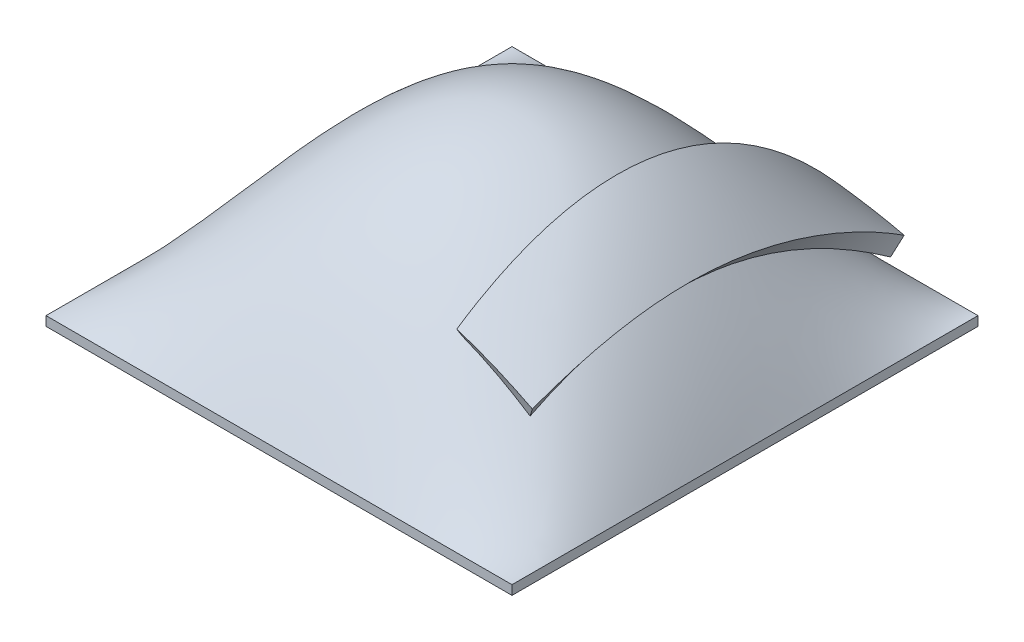
ISO-10303-21;
HEADER;
FILE_DESCRIPTION(('STEP AP214'),'2;1');
FILE_NAME('part.step','',(''),(''),'','','');
FILE_SCHEMA(('AUTOMOTIVE_DESIGN { 1 0 10303 214 1 1 1 1 }'));
ENDSEC;
DATA;
#1=APPLICATION_CONTEXT('core data for automotive mechanical design processes');
#2=APPLICATION_PROTOCOL_DEFINITION('international standard','automotive_design',2000,#1);
#3=PRODUCT_CONTEXT('',#1,'mechanical');
#4=PRODUCT('Part','Part','',(#3));
#5=PRODUCT_RELATED_PRODUCT_CATEGORY('part','',(#4));
#6=PRODUCT_DEFINITION_FORMATION('','',#4);
#7=PRODUCT_DEFINITION_CONTEXT('part definition',#1,'design');
#8=PRODUCT_DEFINITION('design','',#6,#7);
#9=PRODUCT_DEFINITION_SHAPE('','',#8);
#10=(LENGTH_UNIT() NAMED_UNIT(*) SI_UNIT(.MILLI.,.METRE.));
#11=(NAMED_UNIT(*) PLANE_ANGLE_UNIT() SI_UNIT($,.RADIAN.));
#12=(NAMED_UNIT(*) SI_UNIT($,.STERADIAN.) SOLID_ANGLE_UNIT());
#13=UNCERTAINTY_MEASURE_WITH_UNIT(LENGTH_MEASURE(1.E-05),#10,'distance_accuracy_value','');
#14=(GEOMETRIC_REPRESENTATION_CONTEXT(3) GLOBAL_UNCERTAINTY_ASSIGNED_CONTEXT((#13)) GLOBAL_UNIT_ASSIGNED_CONTEXT((#10,
#11,#12)) REPRESENTATION_CONTEXT('',''));
#15=CARTESIAN_POINT('',(0.,0.,0.));
#16=DIRECTION('',(0.,0.,1.));
#17=DIRECTION('',(1.,0.,0.));
#18=AXIS2_PLACEMENT_3D('',#15,#16,#17);
#19=CARTESIAN_POINT('',(352.236400812417,120.066074002992,-94.2678080648068));
#20=CARTESIAN_POINT('',(377.945252083481,110.12521398894,-94.2678080648068));
#21=CARTESIAN_POINT('',(402.095541932773,97.1447702594201,-94.2678080648068));
#22=CARTESIAN_POINT('',(425.149182787163,82.1038303366709,-94.2678080648068));
#23=CARTESIAN_POINT('',(358.101117434809,135.233285610329,-82.6247504338713));
#24=CARTESIAN_POINT('',(385.315926838237,125.438076267371,-83.5730522108363));
#25=CARTESIAN_POINT('',(410.914883568745,112.603418602778,-84.9006707677994));
#26=CARTESIAN_POINT('',(435.241527300565,97.5726299586179,-86.5957274813633));
#27=B_SPLINE_SURFACE_WITH_KNOTS('',1,3,((#19,#20,#21,#22),(#23,#24,#25,#26)),.UNSPECIFIED.,.F.,
.F.,.F.,(2,2),(4,4),(0.,1.),(0.,0.0822034410440224),.UNSPECIFIED.);
#28=CARTESIAN_POINT('',(352.236400812416,120.066074002992,-94.2678080648068));
#29=CARTESIAN_POINT('',(358.101117434809,135.233285610329,-82.6247504338713));
#30=B_SPLINE_CURVE_WITH_KNOTS('',1,(#28,#29),.UNSPECIFIED.,.F.,.F.,(2,2),(0.,1.),.UNSPECIFIED.);
#31=CARTESIAN_POINT('',(352.236400812417,120.066074002992,-94.2678080648068));
#32=VERTEX_POINT('',#31);
#33=CARTESIAN_POINT('',(358.101117434809,135.233285610329,-82.6247504338714));
#34=VERTEX_POINT('',#33);
#35=EDGE_CURVE('E12',#32,#34,#30,.T.);
#36=CARTESIAN_POINT('',(352.236400812417,120.066074002992,-94.2678080648068));
#37=CARTESIAN_POINT('',(377.945252083481,110.12521398894,-94.2678080648068));
#38=CARTESIAN_POINT('',(402.095541932773,97.1447702594201,-94.2678080648068));
#39=CARTESIAN_POINT('',(425.149182787163,82.1038303366709,-94.2678080648068));
#40=B_SPLINE_CURVE_WITH_KNOTS('',3,(#36,#37,#38,#39),.UNSPECIFIED.,.F.,.F.,(4,4),(0.,
0.0822034410440224),.UNSPECIFIED.);
#41=CARTESIAN_POINT('',(425.149182787163,82.1038303366709,-94.2678080648068));
#42=VERTEX_POINT('',#41);
#43=EDGE_CURVE('E109',#32,#42,#40,.T.);
#44=CARTESIAN_POINT('',(425.149182787163,82.1038303366709,-94.2678080648068));
#45=CARTESIAN_POINT('',(435.241527300565,97.5726299586179,-86.5957274813633));
#46=B_SPLINE_CURVE_WITH_KNOTS('',1,(#44,#45),.UNSPECIFIED.,.F.,.F.,(2,2),(0.,1.),.UNSPECIFIED.);
#47=CARTESIAN_POINT('',(435.241527300565,97.5726299586179,-86.5957274813632));
#48=VERTEX_POINT('',#47);
#49=EDGE_CURVE('E67',#42,#48,#46,.T.);
#50=CARTESIAN_POINT('',(358.101117434493,135.23328560985,-82.6247504330873));
#51=CARTESIAN_POINT('',(361.444734268746,134.029851197963,-82.7412492825079));
#52=CARTESIAN_POINT('',(364.770347542425,132.777275873528,-82.8635414172661));
#53=CARTESIAN_POINT('',(371.391332329243,130.175291545743,-83.1201324649657));
#54=CARTESIAN_POINT('',(374.686622964419,128.825679144149,-83.2544567522162));
#55=CARTESIAN_POINT('',(381.246352683932,126.032862993513,-83.5353764652534));
#56=CARTESIAN_POINT('',(384.510695517026,124.589436411588,-83.6820013673793));
#57=CARTESIAN_POINT('',(391.007869537081,121.612186170239,-83.9877115174486));
#58=CARTESIAN_POINT('',(394.240592997445,120.078130901453,-84.1468290653904));
#59=CARTESIAN_POINT('',(400.673717347923,116.922798871033,-84.477627181016));
#60=CARTESIAN_POINT('',(403.874002961273,115.301290807412,-84.6493415453925));
#61=CARTESIAN_POINT('',(410.241321638015,111.974206616375,-85.0053123902598));
#62=CARTESIAN_POINT('',(413.408235973908,110.268407034871,-85.1896027623035));
#63=CARTESIAN_POINT('',(419.707751682306,106.775902709061,-85.5705687418883));
#64=CARTESIAN_POINT('',(422.840234900779,104.98898859197,-85.7672769807413));
#65=CARTESIAN_POINT('',(429.069753165836,101.337370442496,-86.1726986319459));
#66=CARTESIAN_POINT('',(432.166674659702,99.4724759554449,-86.3814419729632));
#67=CARTESIAN_POINT('',(435.24152729993,97.5726299585376,-86.5957274803656));
#68=B_SPLINE_CURVE_WITH_KNOTS('',3,(#50,#51,#52,#53,#54,#55,#56,#57,#58,#59,#60,#61,#62,#63,#64,
#65,#66,#67),.UNSPECIFIED.,.F.,.F.,(4,2,2,2,2,2,2,2,4),(0.,10.6659610616537,21.3549701091742,
32.07036823324,42.8144463522021,53.588486143564,64.3928047841374,75.2268026284994,
86.0890132259185),.UNSPECIFIED.);
#69=EDGE_CURVE('E105',#34,#48,#68,.T.);
#70=ORIENTED_EDGE('',*,*,#35,.F.);
#71=ORIENTED_EDGE('',*,*,#43,.T.);
#72=ORIENTED_EDGE('',*,*,#49,.T.);
#73=ORIENTED_EDGE('',*,*,#69,.F.);
#74=EDGE_LOOP('',(#70,#71,#72,#73));
#75=FACE_BOUND('',#74,.T.);
#76=ADVANCED_FACE('F53',(#75),#27,.F.);
#77=CARTESIAN_POINT('',(425.149182787163,82.1038303366709,-94.2678080648068));
#78=CARTESIAN_POINT('',(425.149182787163,89.7890454692226,-109.763090165147));
#79=CARTESIAN_POINT('',(425.149182787163,96.5278335099268,-125.537576367402));
#80=CARTESIAN_POINT('',(425.149182787163,107.783459375476,-157.741472525574));
#81=CARTESIAN_POINT('',(425.149182787163,112.30095832823,-174.170772784166));
#82=CARTESIAN_POINT('',(425.149182787163,117.136291045383,-199.386960395024));
#83=CARTESIAN_POINT('',(425.149182787163,118.424222885114,-207.887835209389));
#84=CARTESIAN_POINT('',(425.149182787163,119.832004756214,-220.793671720011));
#85=CARTESIAN_POINT('',(425.149182787163,120.214031015862,-225.129447168117));
#86=CARTESIAN_POINT('',(425.149182787163,120.792230526057,-233.766937602276));
#87=CARTESIAN_POINT('',(425.149182787163,120.989723896549,-238.077678158576));
#88=CARTESIAN_POINT('',(425.149182787163,121.523814709346,-259.591764472096));
#89=CARTESIAN_POINT('',(425.149182787163,120.499279720612,-276.676173067539));
#90=CARTESIAN_POINT('',(425.149182787163,116.886755191908,-302.121407218186));
#91=CARTESIAN_POINT('',(425.149182787163,115.336821721953,-310.572939188076));
#92=CARTESIAN_POINT('',(425.149182787163,111.564874089812,-327.417276020784));
#93=CARTESIAN_POINT('',(425.149182787163,109.333503336945,-335.833167727256));
#94=CARTESIAN_POINT('',(425.149182787163,101.799330225185,-360.594014454023));
#95=CARTESIAN_POINT('',(425.149182787163,95.6397662800098,-376.579373060685));
#96=CARTESIAN_POINT('',(425.149182787163,81.4868513833054,-407.708237394581));
#97=CARTESIAN_POINT('',(425.149182787163,73.4923327884509,-422.851207081427));
#98=CARTESIAN_POINT('',(425.149182787163,56.0216225445363,-452.456941653398));
#99=CARTESIAN_POINT('',(425.149182787163,46.5257050296974,-466.942758903788));
#100=CARTESIAN_POINT('',(425.149182787163,36.5334746410542,-481.022564626507));
#101=CARTESIAN_POINT('',(435.241527300565,97.5726299586179,-86.5957274813633));
#102=CARTESIAN_POINT('',(436.233424626653,105.026604275157,-102.929576332862));
#103=CARTESIAN_POINT('',(437.00419136778,111.517095162358,-119.548321541818));
#104=CARTESIAN_POINT('',(438.204772920203,122.338026438718,-153.404825136524));
#105=CARTESIAN_POINT('',(438.636107316384,126.66769081833,-170.643063368185));
#106=CARTESIAN_POINT('',(439.08263809119,131.300258661409,-197.05735484505));
#107=CARTESIAN_POINT('',(439.197692847754,132.533504477032,-205.95542845543));
#108=CARTESIAN_POINT('',(439.322166691158,133.881336567008,-219.457832139951));
#109=CARTESIAN_POINT('',(439.355621021046,134.247045724089,-223.992973114744));
#110=CARTESIAN_POINT('',(439.406080086624,134.800524800578,-233.026307276474));
#111=CARTESIAN_POINT('',(439.423202183896,134.989558402925,-237.533947777272));
#112=CARTESIAN_POINT('',(439.469494381663,135.500769707903,-260.029512748442));
#113=CARTESIAN_POINT('',(439.383456451259,134.520554976663,-277.889793543398));
#114=CARTESIAN_POINT('',(439.059376880399,131.061139321741,-304.522288333706));
#115=CARTESIAN_POINT('',(438.918300344834,129.576598325328,-313.373423444975));
#116=CARTESIAN_POINT('',(438.561822250962,125.961297929071,-331.029288113601));
#117=CARTESIAN_POINT('',(438.34539420171,123.821572301028,-339.858362523521));
#118=CARTESIAN_POINT('',(437.58014307637,116.588556775169,-365.860448632355));
#119=CARTESIAN_POINT('',(436.914059955395,110.667095792958,-382.683772575163));
#120=CARTESIAN_POINT('',(435.189725834188,96.9864089050762,-415.483060380142));
#121=CARTESIAN_POINT('',(434.12826770031,89.2265071831388,-431.459331630104));
#122=CARTESIAN_POINT('',(431.551302542576,72.0878189705827,-462.614609350392));
#123=CARTESIAN_POINT('',(430.026565407345,62.6867262670528,-477.814313942201));
#124=CARTESIAN_POINT('',(428.339469775556,52.6347166266389,-492.449378506733));
#125=B_SPLINE_SURFACE_WITH_KNOTS('',1,3,((#77,#78,#79,#80,#81,#82,#83,#84,#85,#86,#87,#88,#89,
#90,#91,#92,#93,#94,#95,#96,#97,#98,#99,#100),(#101,#102,#103,#104,#105,#106,#107,#108,#109,
#110,#111,#112,#113,#114,#115,#116,#117,#118,#119,#120,#121,#122,#123,#124)),.UNSPECIFIED.,.F.,
.F.,.F.,(2,2),(4,2,2,2,2,2,2,2,2,2,2,4),(0.,1.),(0.,0.0511085665816319,0.102217133163264,
0.12777141645408,0.140548558099488,0.153325699744896,0.204434266326528,0.229988549617344,
0.25554283290816,0.306651399489792,0.357759966071424,0.408868532653056),.UNSPECIFIED.);
#126=CARTESIAN_POINT('',(425.149182787163,82.1038303366709,-94.2678080648068));
#127=CARTESIAN_POINT('',(425.149182787163,89.7890454692226,-109.763090165147));
#128=CARTESIAN_POINT('',(425.149182787163,96.5278335099268,-125.537576367402));
#129=CARTESIAN_POINT('',(425.149182787163,107.783459375476,-157.741472525574));
#130=CARTESIAN_POINT('',(425.149182787163,112.30095832823,-174.170772784166));
#131=CARTESIAN_POINT('',(425.149182787163,117.136291045383,-199.386960395024));
#132=CARTESIAN_POINT('',(425.149182787163,118.424222885114,-207.887835209389));
#133=CARTESIAN_POINT('',(425.149182787163,119.832004756214,-220.793671720011));
#134=CARTESIAN_POINT('',(425.149182787163,120.214031015862,-225.129447168117));
#135=CARTESIAN_POINT('',(425.149182787163,120.792230526057,-233.766937602276));
#136=CARTESIAN_POINT('',(425.149182787163,120.989723896549,-238.077678158576));
#137=CARTESIAN_POINT('',(425.149182787163,121.523814709346,-259.591764472096));
#138=CARTESIAN_POINT('',(425.149182787163,120.499279720612,-276.676173067539));
#139=CARTESIAN_POINT('',(425.149182787163,116.886755191908,-302.121407218186));
#140=CARTESIAN_POINT('',(425.149182787163,115.336821721953,-310.572939188076));
#141=CARTESIAN_POINT('',(425.149182787163,111.564874089812,-327.417276020784));
#142=CARTESIAN_POINT('',(425.149182787163,109.333503336945,-335.833167727256));
#143=CARTESIAN_POINT('',(425.149182787163,101.799330225185,-360.594014454023));
#144=CARTESIAN_POINT('',(425.149182787163,95.6397662800098,-376.579373060685));
#145=CARTESIAN_POINT('',(425.149182787163,81.4868513833054,-407.708237394581));
#146=CARTESIAN_POINT('',(425.149182787163,73.4923327884509,-422.851207081427));
#147=CARTESIAN_POINT('',(425.149182787163,56.0216225445363,-452.456941653398));
#148=CARTESIAN_POINT('',(425.149182787163,46.5257050296974,-466.942758903788));
#149=CARTESIAN_POINT('',(425.149182787163,36.5334746410542,-481.022564626507));
#150=B_SPLINE_CURVE_WITH_KNOTS('',3,(#126,#127,#128,#129,#130,#131,#132,#133,#134,#135,#136,
#137,#138,#139,#140,#141,#142,#143,#144,#145,#146,#147,#148,#149),.UNSPECIFIED.,.F.,.F.,(4,2,2,
2,2,2,2,2,2,2,2,4),(0.,0.0511085665816319,0.102217133163264,0.12777141645408,0.140548558099488,
0.153325699744896,0.204434266326528,0.229988549617344,0.25554283290816,0.306651399489792,
0.357759966071424,0.408868532653056),.UNSPECIFIED.);
#151=CARTESIAN_POINT('',(425.149182787163,36.5334746410542,-481.022564626507));
#152=VERTEX_POINT('',#151);
#153=EDGE_CURVE('E259',#42,#152,#150,.T.);
#154=CARTESIAN_POINT('',(425.149182787163,36.5334746410542,-481.022564626507));
#155=CARTESIAN_POINT('',(428.339469775556,52.6347166266389,-492.449378506733));
#156=B_SPLINE_CURVE_WITH_KNOTS('',1,(#154,#155),.UNSPECIFIED.,.F.,.F.,(2,2),(0.,1.),.UNSPECIFIED.);
#157=CARTESIAN_POINT('',(428.339469775556,52.6347166266389,-492.449378506733));
#158=VERTEX_POINT('',#157);
#159=EDGE_CURVE('E92',#152,#158,#156,.T.);
#160=CARTESIAN_POINT('',(435.241527298709,97.5726299592417,-86.5957274801786));
#161=CARTESIAN_POINT('',(435.550025724608,99.8895489927879,-91.6731279335697));
#162=CARTESIAN_POINT('',(435.838083007822,102.119185255935,-96.7919761303514));
#163=CARTESIAN_POINT('',(436.382337493342,106.44834588407,-107.243114448448));
#164=CARTESIAN_POINT('',(436.637508279255,108.542962621753,-112.577489947589));
#165=CARTESIAN_POINT('',(437.11487515228,112.573039096736,-123.456399979805));
#166=CARTESIAN_POINT('',(437.336113381553,114.503360545532,-129.002885016989));
#167=CARTESIAN_POINT('',(437.745724993086,118.174114653905,-140.303678284412));
#168=CARTESIAN_POINT('',(437.933207350484,119.909041461866,-146.05981152867));
#169=CARTESIAN_POINT('',(438.275843539332,123.157075598125,-157.778740112243));
#170=CARTESIAN_POINT('',(438.430151669346,124.664141446356,-163.743239445451));
#171=CARTESIAN_POINT('',(438.707166364176,127.423249367794,-175.87899159863));
#172=CARTESIAN_POINT('',(438.829048341369,128.668493493044,-182.051815375181));
#173=CARTESIAN_POINT('',(439.032440667158,130.780309272881,-194.092258715403));
#174=CARTESIAN_POINT('',(439.115888741719,131.664710121038,-199.956717469806));
#175=CARTESIAN_POINT('',(439.254908686877,133.153116520304,-211.797974989736));
#176=CARTESIAN_POINT('',(439.310109572844,133.753383092274,-217.775250246997));
#177=CARTESIAN_POINT('',(439.392833705086,134.655808426855,-229.84458737325));
#178=CARTESIAN_POINT('',(439.419920251521,134.953262283042,-235.937005537371));
#179=CARTESIAN_POINT('',(439.444843623762,135.22860049845,-248.052615369924));
#180=CARTESIAN_POINT('',(439.443043244598,135.210448356432,-254.075716326473));
#181=CARTESIAN_POINT('',(439.411641785372,134.865622886129,-266.057243514065));
#182=CARTESIAN_POINT('',(439.382297936632,134.541804053056,-272.015752767737));
#183=CARTESIAN_POINT('',(439.295835133701,133.596932031284,-283.870638744747));
#184=CARTESIAN_POINT('',(439.238894220986,132.977784544618,-289.767169511933));
#185=CARTESIAN_POINT('',(439.090797907635,131.396147496109,-301.942914363653));
#186=CARTESIAN_POINT('',(438.997486141308,130.412263208353,-308.219325864267));
#187=CARTESIAN_POINT('',(438.77854930873,128.153628058575,-320.559392237248));
#188=CARTESIAN_POINT('',(438.653774416758,126.886616876496,-326.624485809845));
#189=CARTESIAN_POINT('',(438.371783449229,124.097374012755,-338.542586378563));
#190=CARTESIAN_POINT('',(438.215409573425,122.58192951383,-344.397206675847));
#191=CARTESIAN_POINT('',(437.869805325657,119.329938444242,-355.893896469225));
#192=CARTESIAN_POINT('',(437.681440094271,117.599473076888,-361.537717176437));
#193=CARTESIAN_POINT('',(437.271529107284,113.94997673928,-372.611301108909));
#194=CARTESIAN_POINT('',(437.050896358338,112.036520707858,-378.042939663848));
#195=CARTESIAN_POINT('',(436.576668440212,108.051954561468,-388.689526714838));
#196=CARTESIAN_POINT('',(436.324050268623,105.986068396264,-393.906478319972));
#197=CARTESIAN_POINT('',(435.762078916937,101.527347529968,-404.596216031404));
#198=CARTESIAN_POINT('',(435.450108228983,99.1219967875963,-410.063641861739));
#199=CARTESIAN_POINT('',(434.781219835167,94.1325592084239,-420.861373251688));
#200=CARTESIAN_POINT('',(434.424672553475,91.5500165761368,-426.19241660131));
#201=CARTESIAN_POINT('',(433.66619932585,86.2249085581973,-436.710475985167));
#202=CARTESIAN_POINT('',(433.264708225952,83.4839828287165,-441.898354171639));
#203=CARTESIAN_POINT('',(432.424142482574,77.8920820203802,-452.063357696328));
#204=CARTESIAN_POINT('',(431.986080187737,75.0448178788584,-457.042611328217));
#205=CARTESIAN_POINT('',(431.048974888,69.0915590452125,-467.076503838063));
#206=CARTESIAN_POINT('',(430.548335790997,65.9799998366897,-472.127696063555));
#207=CARTESIAN_POINT('',(429.757777341442,61.1517479066766,-479.687091172888));
#208=CARTESIAN_POINT('',(429.484059913739,59.4942308130503,-482.235002233857));
#209=CARTESIAN_POINT('',(428.921728786738,56.1101966369559,-487.343700318775));
#210=CARTESIAN_POINT('',(428.632944516266,54.3829940294157,-489.904014518118));
#211=CARTESIAN_POINT('',(428.33946977556,52.6347166271178,-492.449378506057));
#212=B_SPLINE_CURVE_WITH_KNOTS('',3,(#160,#161,#162,#163,#164,#165,#166,#167,#168,#169,#170,
#171,#172,#173,#174,#175,#176,#177,#178,#179,#180,#181,#182,#183,#184,#185,#186,#187,#188,#189,
#190,#191,#192,#193,#194,#195,#196,#197,#198,#199,#200,#201,#202,#203,#204,#205,#206,#207,#208,
#209,#210,#211),.UNSPECIFIED.,.F.,.F.,(4,2,2,2,2,2,2,2,2,2,2,2,2,2,2,2,2,2,2,2,2,2,2,2,2,4),(0.,
16.7683576188505,33.973883282391,51.5997375403208,69.6383818728655,88.0932215564224,
106.9801982578,124.767274280378,142.782319464316,161.073184992336,179.134514733145,
197.028828570356,214.809204341297,233.861644945573,252.446015830021,270.588358530947,
288.301354945864,305.585812534214,322.432259205644,340.371643615796,358.170792182113,
375.810587936847,393.065124607215,410.92265645697,420.078003641002,429.383330601827),.UNSPECIFIED.);
#213=EDGE_CURVE('E122',#48,#158,#212,.T.);
#214=ORIENTED_EDGE('',*,*,#49,.F.);
#215=ORIENTED_EDGE('',*,*,#153,.T.);
#216=ORIENTED_EDGE('',*,*,#159,.T.);
#217=ORIENTED_EDGE('',*,*,#213,.F.);
#218=EDGE_LOOP('',(#214,#215,#216,#217));
#219=FACE_BOUND('',#218,.T.);
#220=ADVANCED_FACE('F130',(#219),#125,.F.);
#221=CARTESIAN_POINT('',(425.149182787163,36.5334746410542,-481.022564626507));
#222=CARTESIAN_POINT('',(413.064708675619,38.9278825105924,-481.022564626507));
#223=CARTESIAN_POINT('',(400.951573272072,41.145857470725,-481.022564626507));
#224=CARTESIAN_POINT('',(376.651418929949,45.1284618134063,-481.022564626507));
#225=CARTESIAN_POINT('',(364.464614535963,46.8940912076447,-481.022564626507));
#226=CARTESIAN_POINT('',(352.236400812417,48.4056309159132,-481.022564626507));
#227=CARTESIAN_POINT('',(428.339469775555,52.6347166266389,-492.449378506733));
#228=CARTESIAN_POINT('',(415.968178233862,54.3882947761706,-493.432433313311));
#229=CARTESIAN_POINT('',(403.57330637072,56.0323120486455,-494.142714048289));
#230=CARTESIAN_POINT('',(378.749384083769,59.0395944710793,-495.259743616212));
#231=CARTESIAN_POINT('',(366.319298514458,60.4004951141268,-495.664926532226));
#232=CARTESIAN_POINT('',(353.864930939866,61.5802861001252,-495.981720698996));
#233=B_SPLINE_SURFACE_WITH_KNOTS('',1,3,((#221,#222,#223,#224,#225,#226),(#227,#228,#229,#230,
#231,#232)),.UNSPECIFIED.,.F.,.F.,.F.,(2,2),(4,2,4),(0.,1.),(0.,0.0369365058915689,
0.0738730117831378),.UNSPECIFIED.);
#234=CARTESIAN_POINT('',(425.149182787163,36.5334746410542,-481.022564626507));
#235=CARTESIAN_POINT('',(413.064708675619,38.9278825105924,-481.022564626507));
#236=CARTESIAN_POINT('',(400.951573272072,41.145857470725,-481.022564626507));
#237=CARTESIAN_POINT('',(376.651418929949,45.1284618134063,-481.022564626507));
#238=CARTESIAN_POINT('',(364.464614535963,46.8940912076447,-481.022564626507));
#239=CARTESIAN_POINT('',(352.236400812417,48.4056309159132,-481.022564626507));
#240=B_SPLINE_CURVE_WITH_KNOTS('',3,(#234,#235,#236,#237,#238,#239),.UNSPECIFIED.,.F.,.F.,(4,2,
4),(0.,0.0369365058915689,0.0738730117831378),.UNSPECIFIED.);
#241=CARTESIAN_POINT('',(352.236400812417,48.4056309159133,-481.022564626507));
#242=VERTEX_POINT('',#241);
#243=EDGE_CURVE('E251',#152,#242,#240,.T.);
#244=CARTESIAN_POINT('',(352.236400812417,48.4056309159132,-481.022564626507));
#245=CARTESIAN_POINT('',(353.864930939866,61.5802861001252,-495.981720698996));
#246=B_SPLINE_CURVE_WITH_KNOTS('',1,(#244,#245),.UNSPECIFIED.,.F.,.F.,(2,2),(0.,1.),.UNSPECIFIED.);
#247=CARTESIAN_POINT('',(353.864930939866,61.5802861001254,-495.981720698996));
#248=VERTEX_POINT('',#247);
#249=EDGE_CURVE('E75',#242,#248,#246,.T.);
#250=CARTESIAN_POINT('',(428.33946977556,52.6347166271178,-492.449378506057));
#251=CARTESIAN_POINT('',(425.46362161693,53.0422608946533,-492.677885050296));
#252=CARTESIAN_POINT('',(422.585787901229,53.4438724941487,-492.891590157503));
#253=CARTESIAN_POINT('',(416.682563794214,54.2544397002916,-493.302632973978));
#254=CARTESIAN_POINT('',(413.656991422397,54.6627581813399,-493.498617709115));
#255=CARTESIAN_POINT('',(407.45953591285,55.4839717572973,-493.873851818407));
#256=CARTESIAN_POINT('',(404.287487215432,55.8961732446849,-494.051874707102));
#257=CARTESIAN_POINT('',(397.798089248989,56.7214948991304,-494.391438882842));
#258=CARTESIAN_POINT('',(394.480583420196,57.1338324279323,-494.551887657588));
#259=CARTESIAN_POINT('',(388.26418165337,57.8869403704757,-494.831579771275));
#260=CARTESIAN_POINT('',(385.365698278769,58.2301438956943,-494.953468390434));
#261=CARTESIAN_POINT('',(379.428868232035,58.9159605733343,-495.187637826006));
#262=CARTESIAN_POINT('',(376.390400574642,59.2577755454285,-495.299189952688));
#263=CARTESIAN_POINT('',(370.17403029286,59.9371153982096,-495.512584803249));
#264=CARTESIAN_POINT('',(366.996008110026,60.27375449562,-495.61376439893));
#265=CARTESIAN_POINT('',(360.500842253214,60.9386480121268,-495.806397749039));
#266=CARTESIAN_POINT('',(357.183580370047,61.2659228288699,-495.897247882204));
#267=CARTESIAN_POINT('',(353.864930939877,61.5802861002212,-495.981720698911));
#268=B_SPLINE_CURVE_WITH_KNOTS('',3,(#250,#251,#252,#253,#254,#255,#256,#257,#258,#259,#260,
#261,#262,#263,#264,#265,#266,#267),.UNSPECIFIED.,.F.,.F.,(4,2,2,2,2,2,2,2,4),(0.,
8.74058027963798,17.918268656855,27.5291318889666,37.5696241287311,46.3333664951743,
55.5122722676336,65.1043738043576,75.1080654637357),.UNSPECIFIED.);
#269=EDGE_CURVE('E132',#158,#248,#268,.T.);
#270=ORIENTED_EDGE('',*,*,#159,.F.);
#271=ORIENTED_EDGE('',*,*,#243,.T.);
#272=ORIENTED_EDGE('',*,*,#249,.T.);
#273=ORIENTED_EDGE('',*,*,#269,.F.);
#274=EDGE_LOOP('',(#270,#271,#272,#273));
#275=FACE_BOUND('',#274,.T.);
#276=ADVANCED_FACE('F154',(#275),#233,.F.);
#277=CARTESIAN_POINT('',(352.236400812417,48.4056309159133,-481.022564626507));
#278=CARTESIAN_POINT('',(352.236400812417,62.3051771364765,-468.781116794453));
#279=CARTESIAN_POINT('',(352.236400812416,75.659405150921,-456.066232453297));
#280=CARTESIAN_POINT('',(352.236400812416,100.950669402067,-429.409740191528));
#281=CARTESIAN_POINT('',(352.236400812417,112.892326829261,-415.471627259768));
#282=CARTESIAN_POINT('',(352.236400812417,129.357112090125,-393.310286787096));
#283=CARTESIAN_POINT('',(352.236400812417,134.602254143988,-385.712554031248));
#284=CARTESIAN_POINT('',(352.236400812417,142.031059534526,-373.935720736288));
#285=CARTESIAN_POINT('',(352.236400812416,144.438975906297,-369.937268315959));
#286=CARTESIAN_POINT('',(352.236400812416,149.055963616309,-361.865248548761));
#287=CARTESIAN_POINT('',(352.236400812417,151.267547704373,-357.788580161907));
#288=CARTESIAN_POINT('',(352.236400812417,161.809592171402,-337.188802406967));
#289=CARTESIAN_POINT('',(352.236400812416,168.610578881897,-320.024002195017));
#290=CARTESIAN_POINT('',(352.236400812416,174.409027815541,-297.434048418407));
#291=CARTESIAN_POINT('',(352.236400812417,175.427412532899,-292.873211723236));
#292=CARTESIAN_POINT('',(352.236400812417,177.151996202698,-283.765373503908));
#293=CARTESIAN_POINT('',(352.236400812417,177.862042214644,-279.203960755429));
#294=CARTESIAN_POINT('',(352.236400812417,179.530766806554,-265.497011439006));
#295=CARTESIAN_POINT('',(352.236400812416,180.028039426715,-256.328764168445));
#296=CARTESIAN_POINT('',(352.236400812416,179.767041612934,-237.930470978399));
#297=CARTESIAN_POINT('',(352.236400812417,179.005687470834,-228.680493486514));
#298=CARTESIAN_POINT('',(352.236400812417,176.214895830485,-210.200406096642));
#299=CARTESIAN_POINT('',(352.236400812417,174.215952359266,-201.146152032938));
#300=CARTESIAN_POINT('',(352.236400812417,169.14435362316,-183.368163820322));
#301=CARTESIAN_POINT('',(352.236400812417,166.071506543749,-174.644488717533));
#302=CARTESIAN_POINT('',(352.236400812417,158.962680577723,-157.493618670529));
#303=CARTESIAN_POINT('',(352.236400812417,154.913190194638,-149.04883337829));
#304=CARTESIAN_POINT('',(352.236400812417,141.69433904288,-124.508296813998));
#305=CARTESIAN_POINT('',(352.236400812416,131.417083849911,-109.054574029768));
#306=CARTESIAN_POINT('',(352.236400812416,120.066074002992,-94.2678080648068));
#307=CARTESIAN_POINT('',(353.864930939866,61.5802861001254,-495.981720698996));
#308=CARTESIAN_POINT('',(354.602339786976,75.8293006539433,-483.352215059131));
#309=CARTESIAN_POINT('',(355.357189662493,89.5385723625534,-470.1614125099));
#310=CARTESIAN_POINT('',(356.867644993561,115.538939784781,-442.324021082801));
#311=CARTESIAN_POINT('',(357.623700367342,127.834892838037,-427.681166167659));
#312=CARTESIAN_POINT('',(358.716174244385,144.813620730968,-404.239738092949));
#313=CARTESIAN_POINT('',(359.073186088483,150.227058418053,-396.1780061147));
#314=CARTESIAN_POINT('',(359.58986627117,157.900193367441,-383.641265251986));
#315=CARTESIAN_POINT('',(359.759290626305,160.388359339017,-379.378202338163));
#316=CARTESIAN_POINT('',(360.087508428818,165.161090253556,-370.758669906222));
#317=CARTESIAN_POINT('',(360.246467145715,167.44824553183,-366.398929919155));
#318=CARTESIAN_POINT('',(361.011319629117,178.354610191924,-344.336631664342));
#319=CARTESIAN_POINT('',(361.52880849662,185.404634868826,-325.84887342726));
#320=CARTESIAN_POINT('',(361.976770373698,191.41982421487,-301.421892358569));
#321=CARTESIAN_POINT('',(362.055948078288,192.476590421966,-296.485768421082));
#322=CARTESIAN_POINT('',(362.190507065451,194.266474540139,-286.621759513435));
#323=CARTESIAN_POINT('',(362.246184297901,195.003582271837,-281.67829671225));
#324=CARTESIAN_POINT('',(362.3772977525,196.736075851896,-266.81668846321));
#325=CARTESIAN_POINT('',(362.416703224535,197.252566665676,-256.86728274363));
#326=CARTESIAN_POINT('',(362.396095955901,196.981530288801,-236.903401222425));
#327=CARTESIAN_POINT('',(362.335835049847,196.190798516222,-226.867379337924));
#328=CARTESIAN_POINT('',(362.117141570313,193.293732228616,-206.839110835072));
#329=CARTESIAN_POINT('',(361.961169950815,191.219104485234,-197.037623756563));
#330=CARTESIAN_POINT('',(361.571344386726,185.959173348088,-177.829302232022));
#331=CARTESIAN_POINT('',(361.337513433835,182.773700150039,-168.422499147182));
#332=CARTESIAN_POINT('',(360.806826072523,175.410477141256,-149.975342572323));
#333=CARTESIAN_POINT('',(360.509070740831,171.218798387737,-140.916341338127));
#334=CARTESIAN_POINT('',(359.558457396789,157.547927874274,-114.667533589578));
#335=CARTESIAN_POINT('',(358.845796360751,146.9342400434,-98.242484927117));
#336=CARTESIAN_POINT('',(358.101117434809,135.233285610329,-82.6247504338713));
#337=B_SPLINE_SURFACE_WITH_KNOTS('',1,3,((#277,#278,#279,#280,#281,#282,#283,#284,#285,#286,
#287,#288,#289,#290,#291,#292,#293,#294,#295,#296,#297,#298,#299,#300,#301,#302,#303,#304,#305,
#306),(#307,#308,#309,#310,#311,#312,#313,#314,#315,#316,#317,#318,#319,#320,#321,#322,#323,
#324,#325,#326,#327,#328,#329,#330,#331,#332,#333,#334,#335,#336)),.UNSPECIFIED.,.F.,.F.,.F.,(2,
2),(4,2,2,2,2,2,2,2,2,2,2,2,2,2,4),(0.,1.),(0.,0.0550615687393015,0.110123137478603,
0.137653921848254,0.151419314033079,0.165184706217905,0.220246274957206,0.234011667142031,
0.247777059326857,0.275307843696508,0.302838628066158,0.330369412435809,0.35790019680546,
0.385430981175111,0.440492549914412),.UNSPECIFIED.);
#338=CARTESIAN_POINT('',(352.236400812417,48.4056309159133,-481.022564626507));
#339=CARTESIAN_POINT('',(352.236400812417,62.3051771364765,-468.781116794453));
#340=CARTESIAN_POINT('',(352.236400812416,75.659405150921,-456.066232453297));
#341=CARTESIAN_POINT('',(352.236400812416,100.950669402067,-429.409740191528));
#342=CARTESIAN_POINT('',(352.236400812417,112.892326829261,-415.471627259768));
#343=CARTESIAN_POINT('',(352.236400812417,129.357112090125,-393.310286787096));
#344=CARTESIAN_POINT('',(352.236400812417,134.602254143988,-385.712554031248));
#345=CARTESIAN_POINT('',(352.236400812417,142.031059534526,-373.935720736288));
#346=CARTESIAN_POINT('',(352.236400812416,144.438975906297,-369.937268315959));
#347=CARTESIAN_POINT('',(352.236400812416,149.055963616309,-361.865248548761));
#348=CARTESIAN_POINT('',(352.236400812417,151.267547704373,-357.788580161907));
#349=CARTESIAN_POINT('',(352.236400812417,161.809592171402,-337.188802406967));
#350=CARTESIAN_POINT('',(352.236400812416,168.610578881897,-320.024002195017));
#351=CARTESIAN_POINT('',(352.236400812416,174.409027815541,-297.434048418407));
#352=CARTESIAN_POINT('',(352.236400812417,175.427412532899,-292.873211723236));
#353=CARTESIAN_POINT('',(352.236400812417,177.151996202698,-283.765373503908));
#354=CARTESIAN_POINT('',(352.236400812417,177.862042214644,-279.203960755429));
#355=CARTESIAN_POINT('',(352.236400812417,179.530766806554,-265.497011439006));
#356=CARTESIAN_POINT('',(352.236400812416,180.028039426715,-256.328764168445));
#357=CARTESIAN_POINT('',(352.236400812416,179.767041612934,-237.930470978399));
#358=CARTESIAN_POINT('',(352.236400812417,179.005687470834,-228.680493486514));
#359=CARTESIAN_POINT('',(352.236400812417,176.214895830485,-210.200406096642));
#360=CARTESIAN_POINT('',(352.236400812417,174.215952359266,-201.146152032938));
#361=CARTESIAN_POINT('',(352.236400812417,169.14435362316,-183.368163820322));
#362=CARTESIAN_POINT('',(352.236400812417,166.071506543749,-174.644488717533));
#363=CARTESIAN_POINT('',(352.236400812417,158.962680577723,-157.493618670529));
#364=CARTESIAN_POINT('',(352.236400812417,154.913190194638,-149.04883337829));
#365=CARTESIAN_POINT('',(352.236400812417,141.69433904288,-124.508296813998));
#366=CARTESIAN_POINT('',(352.236400812416,131.417083849911,-109.054574029768));
#367=CARTESIAN_POINT('',(352.236400812416,120.066074002992,-94.2678080648068));
#368=B_SPLINE_CURVE_WITH_KNOTS('',3,(#338,#339,#340,#341,#342,#343,#344,#345,#346,#347,#348,
#349,#350,#351,#352,#353,#354,#355,#356,#357,#358,#359,#360,#361,#362,#363,#364,#365,#366,#367),
.UNSPECIFIED.,.F.,.F.,(4,2,2,2,2,2,2,2,2,2,2,2,2,2,4),(0.,0.0550615687393015,0.110123137478603,
0.137653921848254,0.151419314033079,0.165184706217905,0.220246274957206,0.234011667142031,
0.247777059326857,0.275307843696508,0.302838628066158,0.330369412435809,0.35790019680546,
0.385430981175111,0.440492549914412),.UNSPECIFIED.);
#369=EDGE_CURVE('E126',#242,#32,#368,.T.);
#370=CARTESIAN_POINT('',(353.864930939724,61.5802861000935,-495.98172069904));
#371=CARTESIAN_POINT('',(354.055213363047,65.2572953878172,-492.72252381659));
#372=CARTESIAN_POINT('',(354.246896109933,68.8996142613133,-489.42434981967));
#373=CARTESIAN_POINT('',(354.6216172217,75.9085135213915,-482.930856009601));
#374=CARTESIAN_POINT('',(354.804546531555,79.2791945244449,-479.739953374749));
#375=CARTESIAN_POINT('',(355.324614973194,88.7275047617914,-470.58811232186));
#376=CARTESIAN_POINT('',(355.663118180212,94.7180510528429,-464.53657345081));
#377=CARTESIAN_POINT('',(356.301152899673,105.750675152823,-452.85110605635));
#378=CARTESIAN_POINT('',(356.600796116553,110.823761837037,-447.246492243339));
#379=CARTESIAN_POINT('',(357.160868902298,120.128139225066,-436.470582944888));
#380=CARTESIAN_POINT('',(357.421807168537,124.388725244339,-431.324669357396));
#381=CARTESIAN_POINT('',(357.906372091239,132.167297696379,-421.481024246079));
#382=CARTESIAN_POINT('',(358.130675919485,135.712567526453,-416.804931462836));
#383=CARTESIAN_POINT('',(358.524861914903,141.841508934909,-408.343171531638));
#384=CARTESIAN_POINT('',(358.695900391346,144.465679195279,-404.586882160297));
#385=CARTESIAN_POINT('',(359.026527774738,149.483279368536,-397.118393022263));
#386=CARTESIAN_POINT('',(359.186307068142,151.881621155419,-393.409507860298));
#387=CARTESIAN_POINT('',(359.494027872069,156.455538735314,-386.037569782658));
#388=CARTESIAN_POINT('',(359.642188254902,158.635999455896,-382.37756081888));
#389=CARTESIAN_POINT('',(359.926312525592,162.782217827001,-375.105125999677));
#390=CARTESIAN_POINT('',(360.062521327585,164.752803328591,-371.49546619634));
#391=CARTESIAN_POINT('',(360.322548645311,168.487342488485,-364.325511469852));
#392=CARTESIAN_POINT('',(360.446630803486,170.256039690777,-360.76770029154));
#393=CARTESIAN_POINT('',(360.682338105548,173.594893102697,-353.703229067056));
#394=CARTESIAN_POINT('',(360.794239557923,175.169681814955,-350.198770720875));
#395=CARTESIAN_POINT('',(361.005648188468,178.128817673169,-343.242779148783));
#396=CARTESIAN_POINT('',(361.10543828329,179.51766157277,-339.793170138787));
#397=CARTESIAN_POINT('',(361.292815216118,182.113003691835,-332.948630024911));
#398=CARTESIAN_POINT('',(361.380685771165,183.323840983102,-329.555354052554));
#399=CARTESIAN_POINT('',(361.544512782099,185.571269851491,-322.825165944464));
#400=CARTESIAN_POINT('',(361.620749187221,186.612023677622,-319.489652841958));
#401=CARTESIAN_POINT('',(361.761772599714,188.527317932243,-312.876700302588));
#402=CARTESIAN_POINT('',(361.826829318125,189.405830293015,-309.60041675829));
#403=CARTESIAN_POINT('',(361.959878750263,191.193727576713,-302.340128211809));
#404=CARTESIAN_POINT('',(362.025746961863,192.072627714021,-298.348522064491));
#405=CARTESIAN_POINT('',(362.141762591571,193.616283008603,-290.377081550623));
#406=CARTESIAN_POINT('',(362.192101165131,194.283645070038,-286.397755147431));
#407=CARTESIAN_POINT('',(362.276980843878,195.406994474918,-278.453041333252));
#408=CARTESIAN_POINT('',(362.311686746785,195.86518758141,-274.487967806701));
#409=CARTESIAN_POINT('',(362.365310863915,196.57317454251,-266.573686650167));
#410=CARTESIAN_POINT('',(362.384363794631,196.824746664444,-262.624641070027));
#411=CARTESIAN_POINT('',(362.401283741214,197.048565538075,-256.705915394017));
#412=CARTESIAN_POINT('',(362.404985812797,197.097651284161,-254.738877711978));
#413=CARTESIAN_POINT('',(362.408551030678,197.14514111072,-250.80955805405));
#414=CARTESIAN_POINT('',(362.408424719618,197.143684374038,-248.847277897302));
#415=CARTESIAN_POINT('',(362.404376942625,197.090445210654,-244.925809570323));
#416=CARTESIAN_POINT('',(362.400460126197,197.038724438434,-242.966620557167));
#417=CARTESIAN_POINT('',(362.388815545086,196.884896271678,-239.042567171618));
#418=CARTESIAN_POINT('',(362.381072863699,196.782591654251,-237.077710754985));
#419=CARTESIAN_POINT('',(362.352002163791,196.398514342622,-231.160737988592));
#420=CARTESIAN_POINT('',(362.324859142922,196.039944071269,-227.213358982041));
#421=CARTESIAN_POINT('',(362.255097771973,195.117352219418,-219.298692290931));
#422=CARTESIAN_POINT('',(362.212311150424,194.551096438657,-215.331669246733));
#423=CARTESIAN_POINT('',(362.111310985894,193.210386491674,-207.379307874098));
#424=CARTESIAN_POINT('',(362.052901217702,192.433282163084,-203.39441926996));
#425=CARTESIAN_POINT('',(361.920781221644,190.6682750022,-195.408071728252));
#426=CARTESIAN_POINT('',(361.846851112441,189.677336373948,-191.407287863796));
#427=CARTESIAN_POINT('',(361.700318462687,187.698819732241,-184.182240075697));
#428=CARTESIAN_POINT('',(361.62991908471,186.743396935737,-180.949063106717));
#429=CARTESIAN_POINT('',(361.478432951086,184.675233676869,-174.419623680752));
#430=CARTESIAN_POINT('',(361.397076366538,183.558438619004,-171.124651442112));
#431=CARTESIAN_POINT('',(361.223232853671,181.159609654014,-164.472822935009));
#432=CARTESIAN_POINT('',(361.130467619435,179.873345379137,-161.117501992719));
#433=CARTESIAN_POINT('',(360.933524742621,177.127542425277,-154.346127519066));
#434=CARTESIAN_POINT('',(360.829066995015,175.66361076865,-150.931865630998));
#435=CARTESIAN_POINT('',(360.608544405603,172.554388091,-144.043804893104));
#436=CARTESIAN_POINT('',(360.492202220843,170.904560135548,-140.572065624203));
#437=CARTESIAN_POINT('',(360.24783206544,167.415395582105,-133.570252002117));
#438=CARTESIAN_POINT('',(360.119535323729,165.571399068734,-130.042512252253));
#439=CARTESIAN_POINT('',(359.851293034587,161.685697515438,-122.929909235439));
#440=CARTESIAN_POINT('',(359.71109324686,159.639233269862,-119.347659231825));
#441=CARTESIAN_POINT('',(359.4192017027,155.340329989965,-112.127232273327));
#442=CARTESIAN_POINT('',(359.267276388663,153.083057083865,-108.49194621778));
#443=CARTESIAN_POINT('',(358.952223046515,148.354285297169,-101.1666766427));
#444=CARTESIAN_POINT('',(358.788888687305,145.877906351631,-97.4798586848583));
#445=CARTESIAN_POINT('',(358.451406006546,140.702395445387,-90.0525587881085));
#446=CARTESIAN_POINT('',(358.277083651322,137.998354509565,-86.3155016648901));
#447=CARTESIAN_POINT('',(358.101117435315,135.233285610343,-82.6247504341441));
#448=B_SPLINE_CURVE_WITH_KNOTS('',3,(#370,#371,#372,#373,#374,#375,#376,#377,#378,#379,#380,
#381,#382,#383,#384,#385,#386,#387,#388,#389,#390,#391,#392,#393,#394,#395,#396,#397,#398,#399,
#400,#401,#402,#403,#404,#405,#406,#407,#408,#409,#410,#411,#412,#413,#414,#415,#416,#417,#418,
#419,#420,#421,#422,#423,#424,#425,#426,#427,#428,#429,#430,#431,#432,#433,#434,#435,#436,#437,
#438,#439,#440,#441,#442,#443,#444,#445,#446,#447),.UNSPECIFIED.,.F.,.F.,(4,2,2,2,2,2,2,2,2,2,2,
2,2,2,2,2,2,2,2,2,2,2,2,2,2,2,2,2,2,2,2,2,2,2,2,2,2,2,4),(0.,14.7511539007766,28.6855054390936,
54.2419682159586,76.9313019979892,96.9826341862256,114.594543680114,128.347758474653,
141.603816290857,154.389474617066,166.730839012559,178.653265818809,190.181265416901,
201.338407804601,212.147232408175,222.629164130048,232.804437611105,245.062369680965,
257.162770215412,269.132439904021,280.997980962953,286.900402543872,292.786571451594,
298.665529413204,304.56759194849,316.453049673509,328.470307804058,340.646231556292,
353.007958161407,363.121823313619,373.559204194497,384.340298061912,395.486515821159,
407.020412814582,418.965611327872,431.346716613728,444.189228274775,457.519448793521,
471.364390905182),.UNSPECIFIED.);
#449=EDGE_CURVE('E124',#248,#34,#448,.T.);
#450=ORIENTED_EDGE('',*,*,#369,.T.);
#451=ORIENTED_EDGE('',*,*,#35,.T.);
#452=ORIENTED_EDGE('',*,*,#449,.F.);
#453=ORIENTED_EDGE('',*,*,#249,.F.);
#454=EDGE_LOOP('',(#450,#451,#452,#453));
#455=FACE_BOUND('',#454,.T.);
#456=ADVANCED_FACE('F55',(#455),#337,.F.);
#457=CARTESIAN_POINT('',(0.,10.,0.));
#458=CARTESIAN_POINT('',(166.666666666667,10.,0.));
#459=CARTESIAN_POINT('',(333.333333333333,10.,0.));
#460=CARTESIAN_POINT('',(500.,10.,0.));
#461=CARTESIAN_POINT('',(0.,10.,-166.666666666667));
#462=CARTESIAN_POINT('',(166.666666666667,347.777777777778,-166.666666666667));
#463=CARTESIAN_POINT('',(333.333333333333,347.777777777778,-166.666666666667));
#464=CARTESIAN_POINT('',(500.,10.,-166.666666666667));
#465=CARTESIAN_POINT('',(0.,10.,-333.333333333333));
#466=CARTESIAN_POINT('',(166.666666666667,347.777777777778,-333.333333333333));
#467=CARTESIAN_POINT('',(333.333333333333,347.777777777778,-333.333333333333));
#468=CARTESIAN_POINT('',(500.,10.,-333.333333333333));
#469=CARTESIAN_POINT('',(0.,10.,-500.));
#470=CARTESIAN_POINT('',(166.666666666667,10.,-500.));
#471=CARTESIAN_POINT('',(333.333333333333,10.,-500.));
#472=CARTESIAN_POINT('',(500.,10.,-500.));
#473=B_SPLINE_SURFACE_WITH_KNOTS('',3,3,((#457,#458,#459,#460),(#461,#462,#463,#464),(#465,#466,
#467,#468),(#469,#470,#471,#472)),.UNSPECIFIED.,.F.,.F.,.F.,(4,4),(4,4),(0.,1.),(0.,1.),.UNSPECIFIED.);
#474=OFFSET_SURFACE('',#473,-30.,.F.);
#475=ORIENTED_EDGE('',*,*,#269,.T.);
#476=ORIENTED_EDGE('',*,*,#449,.T.);
#477=ORIENTED_EDGE('',*,*,#69,.T.);
#478=ORIENTED_EDGE('',*,*,#213,.T.);
#479=EDGE_LOOP('',(#475,#476,#477,#478));
#480=FACE_BOUND('',#479,.T.);
#481=ADVANCED_FACE('F121',(#480),#474,.F.);
#482=CARTESIAN_POINT('',(0.,10.,0.));
#483=CARTESIAN_POINT('',(166.666666666667,10.,0.));
#484=CARTESIAN_POINT('',(333.333333333333,10.,0.));
#485=CARTESIAN_POINT('',(500.,10.,0.));
#486=CARTESIAN_POINT('',(0.,10.,-166.666666666667));
#487=CARTESIAN_POINT('',(166.666666666667,347.777777777778,-166.666666666667));
#488=CARTESIAN_POINT('',(333.333333333333,347.777777777778,-166.666666666667));
#489=CARTESIAN_POINT('',(500.,10.,-166.666666666667));
#490=CARTESIAN_POINT('',(0.,10.,-333.333333333333));
#491=CARTESIAN_POINT('',(166.666666666667,347.777777777778,-333.333333333333));
#492=CARTESIAN_POINT('',(333.333333333333,347.777777777778,-333.333333333333));
#493=CARTESIAN_POINT('',(500.,10.,-333.333333333333));
#494=CARTESIAN_POINT('',(0.,10.,-500.));
#495=CARTESIAN_POINT('',(166.666666666667,10.,-500.));
#496=CARTESIAN_POINT('',(333.333333333333,10.,-500.));
#497=CARTESIAN_POINT('',(500.,10.,-500.));
#498=B_SPLINE_SURFACE_WITH_KNOTS('',3,3,((#482,#483,#484,#485),(#486,#487,#488,#489),(#490,#491,
#492,#493),(#494,#495,#496,#497)),.UNSPECIFIED.,.F.,.F.,.F.,(4,4),(4,4),(0.,1.),(0.,1.),.UNSPECIFIED.);
#499=OFFSET_SURFACE('',#498,-10.,.F.);
#500=ORIENTED_EDGE('',*,*,#243,.F.);
#501=ORIENTED_EDGE('',*,*,#153,.F.);
#502=ORIENTED_EDGE('',*,*,#43,.F.);
#503=ORIENTED_EDGE('',*,*,#369,.F.);
#504=EDGE_LOOP('',(#500,#501,#502,#503));
#505=FACE_BOUND('',#504,.T.);
#506=ADVANCED_FACE('F212',(#505),#499,.T.);
#507=CLOSED_SHELL('',(#76,#220,#276,#456,#481,#506));
#508=MANIFOLD_SOLID_BREP('B2',#507);
#509=CARTESIAN_POINT('',(0.,10.,0.));
#510=DIRECTION('',(1.,0.,0.));
#511=DIRECTION('',(0.,0.,-1.));
#512=AXIS2_PLACEMENT_3D('',#509,#510,#511);
#513=PLANE('',#512);
#514=DIRECTION('',(0.,0.,1.));
#515=VECTOR('',#514,1.);
#516=CARTESIAN_POINT('',(0.,0.,0.));
#517=LINE('',#516,#515);
#518=CARTESIAN_POINT('',(0.,0.,-500.));
#519=VERTEX_POINT('',#518);
#520=CARTESIAN_POINT('',(0.,0.,0.));
#521=VERTEX_POINT('',#520);
#522=EDGE_CURVE('E510',#519,#521,#517,.T.);
#523=ORIENTED_EDGE('',*,*,#522,.T.);
#524=DIRECTION('',(0.,-1.,0.));
#525=VECTOR('',#524,1.);
#526=CARTESIAN_POINT('',(0.,10.,0.));
#527=LINE('',#526,#525);
#528=CARTESIAN_POINT('',(0.,10.,0.));
#529=VERTEX_POINT('',#528);
#530=EDGE_CURVE('E51',#529,#521,#527,.T.);
#531=ORIENTED_EDGE('',*,*,#530,.F.);
#532=DIRECTION('',(0.,0.,1.));
#533=VECTOR('',#532,1.);
#534=CARTESIAN_POINT('',(0.,10.,0.));
#535=LINE('',#534,#533);
#536=CARTESIAN_POINT('',(0.,10.,-500.));
#537=VERTEX_POINT('',#536);
#538=EDGE_CURVE('E525',#537,#529,#535,.T.);
#539=ORIENTED_EDGE('',*,*,#538,.F.);
#540=DIRECTION('',(0.,-1.,0.));
#541=VECTOR('',#540,1.);
#542=CARTESIAN_POINT('',(0.,10.,-500.));
#543=LINE('',#542,#541);
#544=EDGE_CURVE('E517',#537,#519,#543,.T.);
#545=ORIENTED_EDGE('',*,*,#544,.T.);
#546=EDGE_LOOP('',(#523,#531,#539,#545));
#547=FACE_BOUND('',#546,.T.);
#548=ADVANCED_FACE('F453',(#547),#513,.F.);
#549=CARTESIAN_POINT('',(0.,10.,0.));
#550=DIRECTION('',(0.,0.,-1.));
#551=DIRECTION('',(-1.,0.,0.));
#552=AXIS2_PLACEMENT_3D('',#549,#550,#551);
#553=PLANE('',#552);
#554=DIRECTION('',(1.,0.,0.));
#555=VECTOR('',#554,1.);
#556=CARTESIAN_POINT('',(0.,0.,0.));
#557=LINE('',#556,#555);
#558=CARTESIAN_POINT('',(500.,0.,0.));
#559=VERTEX_POINT('',#558);
#560=EDGE_CURVE('E507',#521,#559,#557,.T.);
#561=ORIENTED_EDGE('',*,*,#560,.T.);
#562=DIRECTION('',(0.,-1.,0.));
#563=VECTOR('',#562,1.);
#564=CARTESIAN_POINT('',(500.,10.,0.));
#565=LINE('',#564,#563);
#566=CARTESIAN_POINT('',(500.,10.,0.));
#567=VERTEX_POINT('',#566);
#568=EDGE_CURVE('E466',#567,#559,#565,.T.);
#569=ORIENTED_EDGE('',*,*,#568,.F.);
#570=DIRECTION('',(1.,0.,0.));
#571=VECTOR('',#570,1.);
#572=CARTESIAN_POINT('',(0.,10.,0.));
#573=LINE('',#572,#571);
#574=EDGE_CURVE('E459',#529,#567,#573,.T.);
#575=ORIENTED_EDGE('',*,*,#574,.F.);
#576=ORIENTED_EDGE('',*,*,#530,.T.);
#577=EDGE_LOOP('',(#561,#569,#575,#576));
#578=FACE_BOUND('',#577,.T.);
#579=ADVANCED_FACE('F514',(#578),#553,.F.);
#580=CARTESIAN_POINT('',(500.,10.,0.));
#581=DIRECTION('',(-1.,0.,0.));
#582=DIRECTION('',(0.,0.,1.));
#583=AXIS2_PLACEMENT_3D('',#580,#581,#582);
#584=PLANE('',#583);
#585=DIRECTION('',(0.,0.,-1.));
#586=VECTOR('',#585,1.);
#587=CARTESIAN_POINT('',(500.,0.,0.));
#588=LINE('',#587,#586);
#589=CARTESIAN_POINT('',(500.,0.,-500.));
#590=VERTEX_POINT('',#589);
#591=EDGE_CURVE('E499',#559,#590,#588,.T.);
#592=ORIENTED_EDGE('',*,*,#591,.T.);
#593=DIRECTION('',(0.,-1.,0.));
#594=VECTOR('',#593,1.);
#595=CARTESIAN_POINT('',(500.,10.,-500.));
#596=LINE('',#595,#594);
#597=CARTESIAN_POINT('',(500.,10.,-500.));
#598=VERTEX_POINT('',#597);
#599=EDGE_CURVE('E528',#598,#590,#596,.T.);
#600=ORIENTED_EDGE('',*,*,#599,.F.);
#601=DIRECTION('',(0.,0.,-1.));
#602=VECTOR('',#601,1.);
#603=CARTESIAN_POINT('',(500.,10.,0.));
#604=LINE('',#603,#602);
#605=EDGE_CURVE('E536',#567,#598,#604,.T.);
#606=ORIENTED_EDGE('',*,*,#605,.F.);
#607=ORIENTED_EDGE('',*,*,#568,.T.);
#608=EDGE_LOOP('',(#592,#600,#606,#607));
#609=FACE_BOUND('',#608,.T.);
#610=ADVANCED_FACE('F540',(#609),#584,.F.);
#611=CARTESIAN_POINT('',(0.,10.,-500.));
#612=DIRECTION('',(0.,0.,1.));
#613=DIRECTION('',(1.,0.,0.));
#614=AXIS2_PLACEMENT_3D('',#611,#612,#613);
#615=PLANE('',#614);
#616=DIRECTION('',(-1.,0.,0.));
#617=VECTOR('',#616,1.);
#618=CARTESIAN_POINT('',(0.,0.,-500.));
#619=LINE('',#618,#617);
#620=EDGE_CURVE('E491',#590,#519,#619,.T.);
#621=ORIENTED_EDGE('',*,*,#620,.T.);
#622=ORIENTED_EDGE('',*,*,#544,.F.);
#623=DIRECTION('',(-1.,0.,0.));
#624=VECTOR('',#623,1.);
#625=CARTESIAN_POINT('',(0.,10.,-500.));
#626=LINE('',#625,#624);
#627=EDGE_CURVE('E475',#598,#537,#626,.T.);
#628=ORIENTED_EDGE('',*,*,#627,.F.);
#629=ORIENTED_EDGE('',*,*,#599,.T.);
#630=EDGE_LOOP('',(#621,#622,#628,#629));
#631=FACE_BOUND('',#630,.T.);
#632=ADVANCED_FACE('F541',(#631),#615,.F.);
#633=CARTESIAN_POINT('',(0.,10.,0.));
#634=CARTESIAN_POINT('',(166.666666666667,10.,0.));
#635=CARTESIAN_POINT('',(333.333333333333,10.,0.));
#636=CARTESIAN_POINT('',(500.,10.,0.));
#637=CARTESIAN_POINT('',(0.,10.,-166.666666666667));
#638=CARTESIAN_POINT('',(166.666666666667,347.777777777778,-166.666666666667));
#639=CARTESIAN_POINT('',(333.333333333333,347.777777777778,-166.666666666667));
#640=CARTESIAN_POINT('',(500.,10.,-166.666666666667));
#641=CARTESIAN_POINT('',(0.,10.,-333.333333333333));
#642=CARTESIAN_POINT('',(166.666666666667,347.777777777778,-333.333333333333));
#643=CARTESIAN_POINT('',(333.333333333333,347.777777777778,-333.333333333333));
#644=CARTESIAN_POINT('',(500.,10.,-333.333333333333));
#645=CARTESIAN_POINT('',(0.,10.,-500.));
#646=CARTESIAN_POINT('',(166.666666666667,10.,-500.));
#647=CARTESIAN_POINT('',(333.333333333333,10.,-500.));
#648=CARTESIAN_POINT('',(500.,10.,-500.));
#649=B_SPLINE_SURFACE_WITH_KNOTS('',3,3,((#633,#634,#635,#636),(#637,#638,#639,#640),(#641,#642,
#643,#644),(#645,#646,#647,#648)),.UNSPECIFIED.,.F.,.F.,.F.,(4,4),(4,4),(0.,1.),(0.,1.),.UNSPECIFIED.);
#650=ORIENTED_EDGE('',*,*,#538,.T.);
#651=ORIENTED_EDGE('',*,*,#574,.T.);
#652=ORIENTED_EDGE('',*,*,#605,.T.);
#653=ORIENTED_EDGE('',*,*,#627,.T.);
#654=EDGE_LOOP('',(#650,#651,#652,#653));
#655=FACE_BOUND('',#654,.T.);
#656=ADVANCED_FACE('F455',(#655),#649,.F.);
#657=CARTESIAN_POINT('',(0.,0.,0.));
#658=DIRECTION('',(0.,-1.,0.));
#659=DIRECTION('',(0.,0.,-1.));
#660=AXIS2_PLACEMENT_3D('',#657,#658,#659);
#661=PLANE('',#660);
#662=ORIENTED_EDGE('',*,*,#522,.F.);
#663=ORIENTED_EDGE('',*,*,#620,.F.);
#664=ORIENTED_EDGE('',*,*,#591,.F.);
#665=ORIENTED_EDGE('',*,*,#560,.F.);
#666=EDGE_LOOP('',(#662,#663,#664,#665));
#667=FACE_BOUND('',#666,.T.);
#668=ADVANCED_FACE('F508',(#667),#661,.T.);
#669=CLOSED_SHELL('',(#548,#579,#610,#632,#656,#668));
#670=MANIFOLD_SOLID_BREP('B6',#669);
#671=ADVANCED_BREP_SHAPE_REPRESENTATION('',(#18,#508,#670),#14);
#672=SHAPE_DEFINITION_REPRESENTATION(#9,#671);
ENDSEC;
END-ISO-10303-21;
